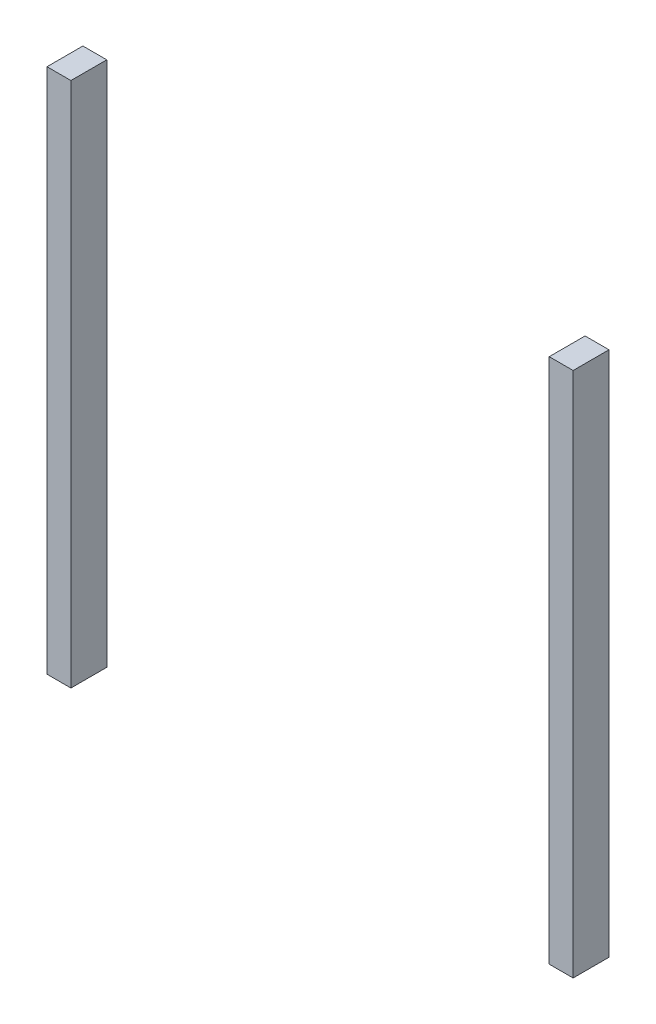
ISO-10303-21;
HEADER;
FILE_DESCRIPTION(('STEP AP214'),'2;1');
FILE_NAME('part.step','',(''),(''),'','','');
FILE_SCHEMA(('AUTOMOTIVE_DESIGN { 1 0 10303 214 1 1 1 1 }'));
ENDSEC;
DATA;
#1=APPLICATION_CONTEXT('core data for automotive mechanical design processes');
#2=APPLICATION_PROTOCOL_DEFINITION('international standard','automotive_design',2000,#1);
#3=PRODUCT_CONTEXT('',#1,'mechanical');
#4=PRODUCT('Part','Part','',(#3));
#5=PRODUCT_RELATED_PRODUCT_CATEGORY('part','',(#4));
#6=PRODUCT_DEFINITION_FORMATION('','',#4);
#7=PRODUCT_DEFINITION_CONTEXT('part definition',#1,'design');
#8=PRODUCT_DEFINITION('design','',#6,#7);
#9=PRODUCT_DEFINITION_SHAPE('','',#8);
#10=(LENGTH_UNIT() NAMED_UNIT(*) SI_UNIT(.MILLI.,.METRE.));
#11=(NAMED_UNIT(*) PLANE_ANGLE_UNIT() SI_UNIT($,.RADIAN.));
#12=(NAMED_UNIT(*) SI_UNIT($,.STERADIAN.) SOLID_ANGLE_UNIT());
#13=UNCERTAINTY_MEASURE_WITH_UNIT(LENGTH_MEASURE(1.E-05),#10,'distance_accuracy_value','');
#14=(GEOMETRIC_REPRESENTATION_CONTEXT(3) GLOBAL_UNCERTAINTY_ASSIGNED_CONTEXT((#13)) GLOBAL_UNIT_ASSIGNED_CONTEXT((#10,
#11,#12)) REPRESENTATION_CONTEXT('',''));
#15=CARTESIAN_POINT('',(0.,0.,0.));
#16=DIRECTION('',(0.,0.,1.));
#17=DIRECTION('',(1.,0.,0.));
#18=AXIS2_PLACEMENT_3D('',#15,#16,#17);
#19=CARTESIAN_POINT('',(139.7,0.,9.525));
#20=DIRECTION('',(-1.,0.,0.));
#21=DIRECTION('',(0.,0.,1.));
#22=AXIS2_PLACEMENT_3D('',#19,#20,#21);
#23=PLANE('',#22);
#24=DIRECTION('',(0.,1.,0.));
#25=VECTOR('',#24,1.);
#26=CARTESIAN_POINT('',(139.7,0.,0.));
#27=LINE('',#26,#25);
#28=CARTESIAN_POINT('',(139.7,0.,0.));
#29=VERTEX_POINT('',#28);
#30=CARTESIAN_POINT('',(139.7,139.7,0.));
#31=VERTEX_POINT('',#30);
#32=EDGE_CURVE('E106',#29,#31,#27,.T.);
#33=ORIENTED_EDGE('',*,*,#32,.T.);
#34=DIRECTION('',(0.,0.,-1.));
#35=VECTOR('',#34,1.);
#36=CARTESIAN_POINT('',(139.7,139.7,9.525));
#37=LINE('',#36,#35);
#38=CARTESIAN_POINT('',(139.7,139.7,9.525));
#39=VERTEX_POINT('',#38);
#40=EDGE_CURVE('E12',#39,#31,#37,.T.);
#41=ORIENTED_EDGE('',*,*,#40,.F.);
#42=DIRECTION('',(0.,1.,0.));
#43=VECTOR('',#42,1.);
#44=CARTESIAN_POINT('',(139.7,0.,9.525));
#45=LINE('',#44,#43);
#46=CARTESIAN_POINT('',(139.7,0.,9.525));
#47=VERTEX_POINT('',#46);
#48=EDGE_CURVE('E94',#47,#39,#45,.T.);
#49=ORIENTED_EDGE('',*,*,#48,.F.);
#50=DIRECTION('',(0.,0.,-1.));
#51=VECTOR('',#50,1.);
#52=CARTESIAN_POINT('',(139.7,0.,9.525));
#53=LINE('',#52,#51);
#54=EDGE_CURVE('E102',#47,#29,#53,.T.);
#55=ORIENTED_EDGE('',*,*,#54,.T.);
#56=EDGE_LOOP('',(#33,#41,#49,#55));
#57=FACE_BOUND('',#56,.T.);
#58=ADVANCED_FACE('F43',(#57),#23,.F.);
#59=CARTESIAN_POINT('',(133.35,139.7,9.525));
#60=DIRECTION('',(0.,-1.,0.));
#61=DIRECTION('',(0.,0.,-1.));
#62=AXIS2_PLACEMENT_3D('',#59,#60,#61);
#63=PLANE('',#62);
#64=DIRECTION('',(-1.,0.,0.));
#65=VECTOR('',#64,1.);
#66=CARTESIAN_POINT('',(133.35,139.7,0.));
#67=LINE('',#66,#65);
#68=CARTESIAN_POINT('',(133.35,139.7,0.));
#69=VERTEX_POINT('',#68);
#70=EDGE_CURVE('E98',#31,#69,#67,.T.);
#71=ORIENTED_EDGE('',*,*,#70,.T.);
#72=DIRECTION('',(0.,0.,-1.));
#73=VECTOR('',#72,1.);
#74=CARTESIAN_POINT('',(133.35,139.7,9.525));
#75=LINE('',#74,#73);
#76=CARTESIAN_POINT('',(133.35,139.7,9.525));
#77=VERTEX_POINT('',#76);
#78=EDGE_CURVE('E51',#77,#69,#75,.T.);
#79=ORIENTED_EDGE('',*,*,#78,.F.);
#80=DIRECTION('',(-1.,0.,0.));
#81=VECTOR('',#80,1.);
#82=CARTESIAN_POINT('',(133.35,139.7,9.525));
#83=LINE('',#82,#81);
#84=EDGE_CURVE('E89',#39,#77,#83,.T.);
#85=ORIENTED_EDGE('',*,*,#84,.F.);
#86=ORIENTED_EDGE('',*,*,#40,.T.);
#87=EDGE_LOOP('',(#71,#79,#85,#86));
#88=FACE_BOUND('',#87,.T.);
#89=ADVANCED_FACE('F97',(#88),#63,.F.);
#90=CARTESIAN_POINT('',(133.35,139.7,9.525));
#91=DIRECTION('',(1.,0.,0.));
#92=DIRECTION('',(0.,1.,0.));
#93=AXIS2_PLACEMENT_3D('',#90,#91,#92);
#94=PLANE('',#93);
#95=DIRECTION('',(0.,-1.,0.));
#96=VECTOR('',#95,1.);
#97=CARTESIAN_POINT('',(133.35,139.7,0.));
#98=LINE('',#97,#96);
#99=CARTESIAN_POINT('',(133.35,0.,0.));
#100=VERTEX_POINT('',#99);
#101=EDGE_CURVE('E76',#69,#100,#98,.T.);
#102=ORIENTED_EDGE('',*,*,#101,.T.);
#103=DIRECTION('',(0.,0.,-1.));
#104=VECTOR('',#103,1.);
#105=CARTESIAN_POINT('',(133.35,0.,9.525));
#106=LINE('',#105,#104);
#107=CARTESIAN_POINT('',(133.35,0.,9.525));
#108=VERTEX_POINT('',#107);
#109=EDGE_CURVE('E99',#108,#100,#106,.T.);
#110=ORIENTED_EDGE('',*,*,#109,.F.);
#111=DIRECTION('',(0.,-1.,0.));
#112=VECTOR('',#111,1.);
#113=CARTESIAN_POINT('',(133.35,139.7,9.525));
#114=LINE('',#113,#112);
#115=EDGE_CURVE('E92',#77,#108,#114,.T.);
#116=ORIENTED_EDGE('',*,*,#115,.F.);
#117=ORIENTED_EDGE('',*,*,#78,.T.);
#118=EDGE_LOOP('',(#102,#110,#116,#117));
#119=FACE_BOUND('',#118,.T.);
#120=ADVANCED_FACE('F100',(#119),#94,.F.);
#121=CARTESIAN_POINT('',(133.35,0.,9.525));
#122=DIRECTION('',(0.,1.,0.));
#123=DIRECTION('',(0.,0.,1.));
#124=AXIS2_PLACEMENT_3D('',#121,#122,#123);
#125=PLANE('',#124);
#126=DIRECTION('',(1.,0.,0.));
#127=VECTOR('',#126,1.);
#128=CARTESIAN_POINT('',(133.35,0.,0.));
#129=LINE('',#128,#127);
#130=EDGE_CURVE('E82',#100,#29,#129,.T.);
#131=ORIENTED_EDGE('',*,*,#130,.T.);
#132=ORIENTED_EDGE('',*,*,#54,.F.);
#133=DIRECTION('',(1.,0.,0.));
#134=VECTOR('',#133,1.);
#135=CARTESIAN_POINT('',(133.35,0.,9.525));
#136=LINE('',#135,#134);
#137=EDGE_CURVE('E59',#108,#47,#136,.T.);
#138=ORIENTED_EDGE('',*,*,#137,.F.);
#139=ORIENTED_EDGE('',*,*,#109,.T.);
#140=EDGE_LOOP('',(#131,#132,#138,#139));
#141=FACE_BOUND('',#140,.T.);
#142=ADVANCED_FACE('F113',(#141),#125,.F.);
#143=CARTESIAN_POINT('',(0.,0.,9.525));
#144=DIRECTION('',(0.,0.,-1.));
#145=DIRECTION('',(-1.,0.,0.));
#146=AXIS2_PLACEMENT_3D('',#143,#144,#145);
#147=PLANE('',#146);
#148=ORIENTED_EDGE('',*,*,#48,.T.);
#149=ORIENTED_EDGE('',*,*,#84,.T.);
#150=ORIENTED_EDGE('',*,*,#115,.T.);
#151=ORIENTED_EDGE('',*,*,#137,.T.);
#152=EDGE_LOOP('',(#148,#149,#150,#151));
#153=FACE_BOUND('',#152,.T.);
#154=ADVANCED_FACE('F90',(#153),#147,.F.);
#155=CARTESIAN_POINT('',(0.,0.,0.));
#156=DIRECTION('',(0.,0.,-1.));
#157=DIRECTION('',(-1.,0.,0.));
#158=AXIS2_PLACEMENT_3D('',#155,#156,#157);
#159=PLANE('',#158);
#160=ORIENTED_EDGE('',*,*,#32,.F.);
#161=ORIENTED_EDGE('',*,*,#130,.F.);
#162=ORIENTED_EDGE('',*,*,#101,.F.);
#163=ORIENTED_EDGE('',*,*,#70,.F.);
#164=EDGE_LOOP('',(#160,#161,#162,#163));
#165=FACE_BOUND('',#164,.T.);
#166=ADVANCED_FACE('F116',(#165),#159,.T.);
#167=CLOSED_SHELL('',(#58,#89,#120,#142,#154,#166));
#168=MANIFOLD_SOLID_BREP('B2',#167);
#169=CARTESIAN_POINT('',(0.,0.,9.525));
#170=DIRECTION('',(1.,0.,0.));
#171=DIRECTION('',(0.,1.,0.));
#172=AXIS2_PLACEMENT_3D('',#169,#170,#171);
#173=PLANE('',#172);
#174=DIRECTION('',(0.,-1.,0.));
#175=VECTOR('',#174,1.);
#176=CARTESIAN_POINT('',(0.,0.,0.));
#177=LINE('',#176,#175);
#178=CARTESIAN_POINT('',(0.,139.7,0.));
#179=VERTEX_POINT('',#178);
#180=CARTESIAN_POINT('',(0.,0.,0.));
#181=VERTEX_POINT('',#180);
#182=EDGE_CURVE('E230',#179,#181,#177,.T.);
#183=ORIENTED_EDGE('',*,*,#182,.T.);
#184=DIRECTION('',(0.,0.,-1.));
#185=VECTOR('',#184,1.);
#186=CARTESIAN_POINT('',(0.,0.,9.525));
#187=LINE('',#186,#185);
#188=CARTESIAN_POINT('',(0.,0.,9.525));
#189=VERTEX_POINT('',#188);
#190=EDGE_CURVE('E41',#189,#181,#187,.T.);
#191=ORIENTED_EDGE('',*,*,#190,.F.);
#192=DIRECTION('',(0.,-1.,0.));
#193=VECTOR('',#192,1.);
#194=CARTESIAN_POINT('',(0.,0.,9.525));
#195=LINE('',#194,#193);
#196=CARTESIAN_POINT('',(0.,139.7,9.525));
#197=VERTEX_POINT('',#196);
#198=EDGE_CURVE('E218',#197,#189,#195,.T.);
#199=ORIENTED_EDGE('',*,*,#198,.F.);
#200=DIRECTION('',(0.,0.,-1.));
#201=VECTOR('',#200,1.);
#202=CARTESIAN_POINT('',(0.,139.7,9.525));
#203=LINE('',#202,#201);
#204=EDGE_CURVE('E226',#197,#179,#203,.T.);
#205=ORIENTED_EDGE('',*,*,#204,.T.);
#206=EDGE_LOOP('',(#183,#191,#199,#205));
#207=FACE_BOUND('',#206,.T.);
#208=ADVANCED_FACE('F167',(#207),#173,.F.);
#209=CARTESIAN_POINT('',(0.,0.,9.525));
#210=DIRECTION('',(0.,1.,0.));
#211=DIRECTION('',(0.,0.,1.));
#212=AXIS2_PLACEMENT_3D('',#209,#210,#211);
#213=PLANE('',#212);
#214=DIRECTION('',(1.,0.,0.));
#215=VECTOR('',#214,1.);
#216=CARTESIAN_POINT('',(0.,0.,0.));
#217=LINE('',#216,#215);
#218=CARTESIAN_POINT('',(6.35000000000002,0.,0.));
#219=VERTEX_POINT('',#218);
#220=EDGE_CURVE('E222',#181,#219,#217,.T.);
#221=ORIENTED_EDGE('',*,*,#220,.T.);
#222=DIRECTION('',(0.,0.,-1.));
#223=VECTOR('',#222,1.);
#224=CARTESIAN_POINT('',(6.35000000000002,0.,9.525));
#225=LINE('',#224,#223);
#226=CARTESIAN_POINT('',(6.35000000000002,0.,9.525));
#227=VERTEX_POINT('',#226);
#228=EDGE_CURVE('E175',#227,#219,#225,.T.);
#229=ORIENTED_EDGE('',*,*,#228,.F.);
#230=DIRECTION('',(1.,0.,0.));
#231=VECTOR('',#230,1.);
#232=CARTESIAN_POINT('',(0.,0.,9.525));
#233=LINE('',#232,#231);
#234=EDGE_CURVE('E213',#189,#227,#233,.T.);
#235=ORIENTED_EDGE('',*,*,#234,.F.);
#236=ORIENTED_EDGE('',*,*,#190,.T.);
#237=EDGE_LOOP('',(#221,#229,#235,#236));
#238=FACE_BOUND('',#237,.T.);
#239=ADVANCED_FACE('F221',(#238),#213,.F.);
#240=CARTESIAN_POINT('',(6.35,139.7,9.525));
#241=DIRECTION('',(-1.,0.,0.));
#242=DIRECTION('',(0.,-1.,0.));
#243=AXIS2_PLACEMENT_3D('',#240,#241,#242);
#244=PLANE('',#243);
#245=DIRECTION('',(0.,1.,0.));
#246=VECTOR('',#245,1.);
#247=CARTESIAN_POINT('',(6.35,139.7,0.));
#248=LINE('',#247,#246);
#249=CARTESIAN_POINT('',(6.35,139.7,0.));
#250=VERTEX_POINT('',#249);
#251=EDGE_CURVE('E200',#219,#250,#248,.T.);
#252=ORIENTED_EDGE('',*,*,#251,.T.);
#253=DIRECTION('',(0.,0.,-1.));
#254=VECTOR('',#253,1.);
#255=CARTESIAN_POINT('',(6.35,139.7,9.525));
#256=LINE('',#255,#254);
#257=CARTESIAN_POINT('',(6.35,139.7,9.525));
#258=VERTEX_POINT('',#257);
#259=EDGE_CURVE('E223',#258,#250,#256,.T.);
#260=ORIENTED_EDGE('',*,*,#259,.F.);
#261=DIRECTION('',(0.,1.,0.));
#262=VECTOR('',#261,1.);
#263=CARTESIAN_POINT('',(6.35,139.7,9.525));
#264=LINE('',#263,#262);
#265=EDGE_CURVE('E216',#227,#258,#264,.T.);
#266=ORIENTED_EDGE('',*,*,#265,.F.);
#267=ORIENTED_EDGE('',*,*,#228,.T.);
#268=EDGE_LOOP('',(#252,#260,#266,#267));
#269=FACE_BOUND('',#268,.T.);
#270=ADVANCED_FACE('F224',(#269),#244,.F.);
#271=CARTESIAN_POINT('',(0.,139.7,9.525));
#272=DIRECTION('',(0.,-1.,0.));
#273=DIRECTION('',(0.,0.,-1.));
#274=AXIS2_PLACEMENT_3D('',#271,#272,#273);
#275=PLANE('',#274);
#276=DIRECTION('',(-1.,0.,0.));
#277=VECTOR('',#276,1.);
#278=CARTESIAN_POINT('',(0.,139.7,0.));
#279=LINE('',#278,#277);
#280=EDGE_CURVE('E206',#250,#179,#279,.T.);
#281=ORIENTED_EDGE('',*,*,#280,.T.);
#282=ORIENTED_EDGE('',*,*,#204,.F.);
#283=DIRECTION('',(-1.,0.,0.));
#284=VECTOR('',#283,1.);
#285=CARTESIAN_POINT('',(0.,139.7,9.525));
#286=LINE('',#285,#284);
#287=EDGE_CURVE('E183',#258,#197,#286,.T.);
#288=ORIENTED_EDGE('',*,*,#287,.F.);
#289=ORIENTED_EDGE('',*,*,#259,.T.);
#290=EDGE_LOOP('',(#281,#282,#288,#289));
#291=FACE_BOUND('',#290,.T.);
#292=ADVANCED_FACE('F237',(#291),#275,.F.);
#293=CARTESIAN_POINT('',(0.,0.,9.525));
#294=DIRECTION('',(0.,0.,-1.));
#295=DIRECTION('',(-1.,0.,0.));
#296=AXIS2_PLACEMENT_3D('',#293,#294,#295);
#297=PLANE('',#296);
#298=ORIENTED_EDGE('',*,*,#198,.T.);
#299=ORIENTED_EDGE('',*,*,#234,.T.);
#300=ORIENTED_EDGE('',*,*,#265,.T.);
#301=ORIENTED_EDGE('',*,*,#287,.T.);
#302=EDGE_LOOP('',(#298,#299,#300,#301));
#303=FACE_BOUND('',#302,.T.);
#304=ADVANCED_FACE('F214',(#303),#297,.F.);
#305=CARTESIAN_POINT('',(0.,0.,0.));
#306=DIRECTION('',(0.,0.,-1.));
#307=DIRECTION('',(-1.,0.,0.));
#308=AXIS2_PLACEMENT_3D('',#305,#306,#307);
#309=PLANE('',#308);
#310=ORIENTED_EDGE('',*,*,#182,.F.);
#311=ORIENTED_EDGE('',*,*,#280,.F.);
#312=ORIENTED_EDGE('',*,*,#251,.F.);
#313=ORIENTED_EDGE('',*,*,#220,.F.);
#314=EDGE_LOOP('',(#310,#311,#312,#313));
#315=FACE_BOUND('',#314,.T.);
#316=ADVANCED_FACE('F240',(#315),#309,.T.);
#317=CLOSED_SHELL('',(#208,#239,#270,#292,#304,#316));
#318=MANIFOLD_SOLID_BREP('B6',#317);
#319=ADVANCED_BREP_SHAPE_REPRESENTATION('',(#18,#168,#318),#14);
#320=SHAPE_DEFINITION_REPRESENTATION(#9,#319);
ENDSEC;
END-ISO-10303-21;
